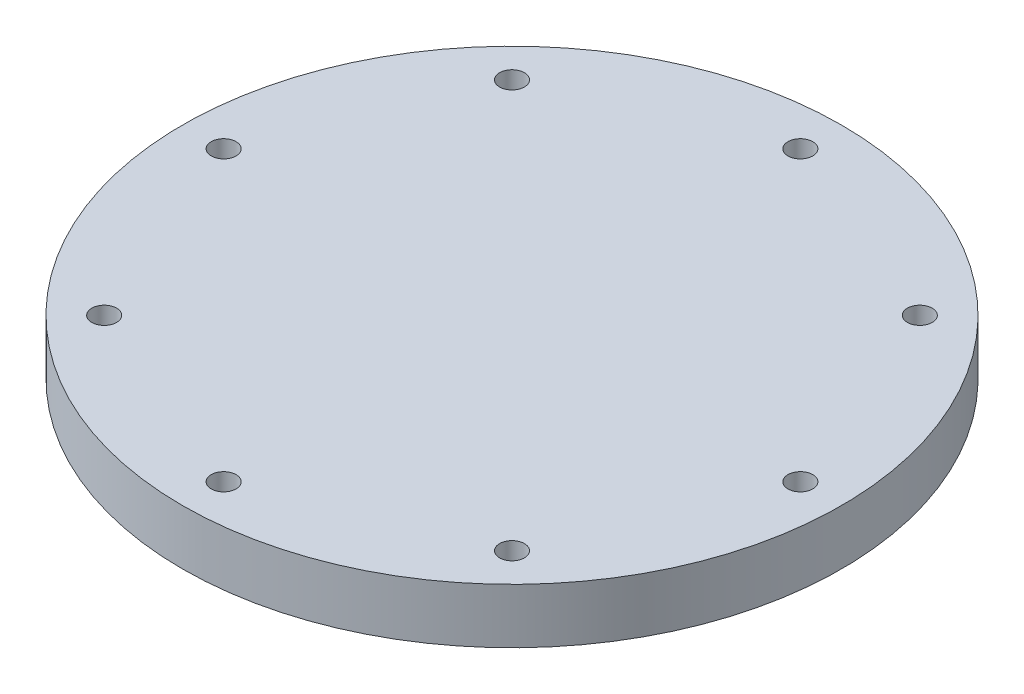
ISO-10303-21;
HEADER;
FILE_DESCRIPTION(('STEP AP214'),'2;1');
FILE_NAME('part.step','',(''),(''),'','','');
FILE_SCHEMA(('AUTOMOTIVE_DESIGN { 1 0 10303 214 1 1 1 1 }'));
ENDSEC;
DATA;
#1=APPLICATION_CONTEXT('core data for automotive mechanical design processes');
#2=APPLICATION_PROTOCOL_DEFINITION('international standard','automotive_design',2000,#1);
#3=PRODUCT_CONTEXT('',#1,'mechanical');
#4=PRODUCT('Part','Part','',(#3));
#5=PRODUCT_RELATED_PRODUCT_CATEGORY('part','',(#4));
#6=PRODUCT_DEFINITION_FORMATION('','',#4);
#7=PRODUCT_DEFINITION_CONTEXT('part definition',#1,'design');
#8=PRODUCT_DEFINITION('design','',#6,#7);
#9=PRODUCT_DEFINITION_SHAPE('','',#8);
#10=(LENGTH_UNIT() NAMED_UNIT(*) SI_UNIT(.MILLI.,.METRE.));
#11=(NAMED_UNIT(*) PLANE_ANGLE_UNIT() SI_UNIT($,.RADIAN.));
#12=(NAMED_UNIT(*) SI_UNIT($,.STERADIAN.) SOLID_ANGLE_UNIT());
#13=UNCERTAINTY_MEASURE_WITH_UNIT(LENGTH_MEASURE(1.E-05),#10,'distance_accuracy_value','');
#14=(GEOMETRIC_REPRESENTATION_CONTEXT(3) GLOBAL_UNCERTAINTY_ASSIGNED_CONTEXT((#13)) GLOBAL_UNIT_ASSIGNED_CONTEXT((#10,
#11,#12)) REPRESENTATION_CONTEXT('',''));
#15=CARTESIAN_POINT('',(0.,0.,0.));
#16=DIRECTION('',(0.,0.,1.));
#17=DIRECTION('',(1.,0.,0.));
#18=AXIS2_PLACEMENT_3D('',#15,#16,#17);
#19=CARTESIAN_POINT('',(0.,6.35,0.));
#20=DIRECTION('',(0.,-1.,0.));
#21=DIRECTION('',(0.,0.,-1.));
#22=AXIS2_PLACEMENT_3D('',#19,#20,#21);
#23=CYLINDRICAL_SURFACE('',#22,38.1);
#24=CARTESIAN_POINT('',(0.,6.35,0.));
#25=DIRECTION('',(0.,1.,0.));
#26=DIRECTION('',(0.,0.,1.));
#27=AXIS2_PLACEMENT_3D('',#24,#25,#26);
#28=CIRCLE('',#27,38.1);
#29=CARTESIAN_POINT('',(0.,6.35,38.1));
#30=VERTEX_POINT('',#29);
#31=EDGE_CURVE('E12',#30,#30,#28,.T.);
#32=ORIENTED_EDGE('',*,*,#31,.F.);
#33=EDGE_LOOP('',(#32));
#34=FACE_BOUND('',#33,.T.);
#35=CARTESIAN_POINT('',(0.,0.,0.));
#36=DIRECTION('',(0.,1.,0.));
#37=DIRECTION('',(0.,0.,1.));
#38=AXIS2_PLACEMENT_3D('',#35,#36,#37);
#39=CIRCLE('',#38,38.1);
#40=CARTESIAN_POINT('',(0.,0.,38.1));
#41=VERTEX_POINT('',#40);
#42=EDGE_CURVE('E48',#41,#41,#39,.T.);
#43=ORIENTED_EDGE('',*,*,#42,.T.);
#44=EDGE_LOOP('',(#43));
#45=FACE_BOUND('',#44,.T.);
#46=ADVANCED_FACE('F45',(#34,#45),#23,.T.);
#47=CARTESIAN_POINT('',(0.,6.35,0.));
#48=DIRECTION('',(0.,1.,0.));
#49=DIRECTION('',(0.,0.,1.));
#50=AXIS2_PLACEMENT_3D('',#47,#48,#49);
#51=PLANE('',#50);
#52=CARTESIAN_POINT('',(-23.5731723178062,6.35,23.5731723178068));
#53=DIRECTION('',(0.,-1.,0.));
#54=DIRECTION('',(0.,0.,-1.));
#55=AXIS2_PLACEMENT_3D('',#52,#53,#54);
#56=CIRCLE('',#55,1.4351);
#57=CARTESIAN_POINT('',(-23.5731723178062,6.35,22.1380723178068));
#58=VERTEX_POINT('',#57);
#59=EDGE_CURVE('E140',#58,#58,#56,.T.);
#60=ORIENTED_EDGE('',*,*,#59,.T.);
#61=EDGE_LOOP('',(#60));
#62=FACE_BOUND('',#61,.T.);
#63=CARTESIAN_POINT('',(-33.3375,6.35,3.49191777401049E-13));
#64=DIRECTION('',(0.,-1.,0.));
#65=DIRECTION('',(0.,0.,-1.));
#66=AXIS2_PLACEMENT_3D('',#63,#64,#65);
#67=CIRCLE('',#66,1.4351);
#68=CARTESIAN_POINT('',(-33.3375,6.35,-1.43509999999965));
#69=VERTEX_POINT('',#68);
#70=EDGE_CURVE('E128',#69,#69,#67,.T.);
#71=ORIENTED_EDGE('',*,*,#70,.T.);
#72=EDGE_LOOP('',(#71));
#73=FACE_BOUND('',#72,.T.);
#74=CARTESIAN_POINT('',(-23.5731723178067,6.35,-23.5731723178063));
#75=DIRECTION('',(0.,-1.,0.));
#76=DIRECTION('',(0.,0.,-1.));
#77=AXIS2_PLACEMENT_3D('',#74,#75,#76);
#78=CIRCLE('',#77,1.4351);
#79=CARTESIAN_POINT('',(-23.5731723178067,6.35,-25.0082723178063));
#80=VERTEX_POINT('',#79);
#81=EDGE_CURVE('E116',#80,#80,#78,.T.);
#82=ORIENTED_EDGE('',*,*,#81,.T.);
#83=EDGE_LOOP('',(#82));
#84=FACE_BOUND('',#83,.T.);
#85=CARTESIAN_POINT('',(0.,6.35,-33.3375));
#86=DIRECTION('',(0.,-1.,0.));
#87=DIRECTION('',(0.,0.,-1.));
#88=AXIS2_PLACEMENT_3D('',#85,#86,#87);
#89=CIRCLE('',#88,1.4351);
#90=CARTESIAN_POINT('',(0.,6.35,-34.7726));
#91=VERTEX_POINT('',#90);
#92=EDGE_CURVE('E104',#91,#91,#89,.T.);
#93=ORIENTED_EDGE('',*,*,#92,.T.);
#94=EDGE_LOOP('',(#93));
#95=FACE_BOUND('',#94,.T.);
#96=CARTESIAN_POINT('',(23.5731723178064,6.35,-23.5731723178067));
#97=DIRECTION('',(0.,-1.,0.));
#98=DIRECTION('',(0.,0.,-1.));
#99=AXIS2_PLACEMENT_3D('',#96,#97,#98);
#100=CIRCLE('',#99,1.4351);
#101=CARTESIAN_POINT('',(23.5731723178064,6.35,-25.0082723178067));
#102=VERTEX_POINT('',#101);
#103=EDGE_CURVE('E92',#102,#102,#100,.T.);
#104=ORIENTED_EDGE('',*,*,#103,.T.);
#105=EDGE_LOOP('',(#104));
#106=FACE_BOUND('',#105,.T.);
#107=CARTESIAN_POINT('',(33.3375,6.35,-1.16397259133683E-13));
#108=DIRECTION('',(0.,-1.,0.));
#109=DIRECTION('',(0.,0.,-1.));
#110=AXIS2_PLACEMENT_3D('',#107,#108,#109);
#111=CIRCLE('',#110,1.4351);
#112=CARTESIAN_POINT('',(33.3375,6.35,-1.43510000000012));
#113=VERTEX_POINT('',#112);
#114=EDGE_CURVE('E80',#113,#113,#111,.T.);
#115=ORIENTED_EDGE('',*,*,#114,.T.);
#116=EDGE_LOOP('',(#115));
#117=FACE_BOUND('',#116,.T.);
#118=CARTESIAN_POINT('',(23.5731723178066,6.35,23.5731723178065));
#119=DIRECTION('',(0.,-1.,0.));
#120=DIRECTION('',(0.,0.,-1.));
#121=AXIS2_PLACEMENT_3D('',#118,#119,#120);
#122=CIRCLE('',#121,1.4351);
#123=CARTESIAN_POINT('',(23.5731723178066,6.35,22.1380723178065));
#124=VERTEX_POINT('',#123);
#125=EDGE_CURVE('E68',#124,#124,#122,.T.);
#126=ORIENTED_EDGE('',*,*,#125,.T.);
#127=EDGE_LOOP('',(#126));
#128=FACE_BOUND('',#127,.T.);
#129=CARTESIAN_POINT('',(0.,6.35,33.3375));
#130=DIRECTION('',(0.,-1.,0.));
#131=DIRECTION('',(0.,0.,-1.));
#132=AXIS2_PLACEMENT_3D('',#129,#130,#131);
#133=CIRCLE('',#132,1.4351);
#134=CARTESIAN_POINT('',(0.,6.35,31.9024));
#135=VERTEX_POINT('',#134);
#136=EDGE_CURVE('E55',#135,#135,#133,.T.);
#137=ORIENTED_EDGE('',*,*,#136,.T.);
#138=EDGE_LOOP('',(#137));
#139=FACE_BOUND('',#138,.T.);
#140=ORIENTED_EDGE('',*,*,#31,.T.);
#141=EDGE_LOOP('',(#140));
#142=FACE_BOUND('',#141,.T.);
#143=ADVANCED_FACE('F159',(#62,#73,#84,#95,#106,#117,#128,#139,#142),#51,.T.);
#144=CARTESIAN_POINT('',(0.,0.,0.));
#145=DIRECTION('',(0.,1.,0.));
#146=DIRECTION('',(0.,0.,1.));
#147=AXIS2_PLACEMENT_3D('',#144,#145,#146);
#148=PLANE('',#147);
#149=CARTESIAN_POINT('',(-23.5731723178062,0.,23.5731723178068));
#150=DIRECTION('',(0.,-1.,0.));
#151=DIRECTION('',(0.,0.,-1.));
#152=AXIS2_PLACEMENT_3D('',#149,#150,#151);
#153=CIRCLE('',#152,2.413);
#154=CARTESIAN_POINT('',(-23.5731723178062,0.,21.1601723178068));
#155=VERTEX_POINT('',#154);
#156=EDGE_CURVE('E149',#155,#155,#153,.T.);
#157=ORIENTED_EDGE('',*,*,#156,.F.);
#158=EDGE_LOOP('',(#157));
#159=FACE_BOUND('',#158,.T.);
#160=CARTESIAN_POINT('',(-33.3375,0.,3.49191777401049E-13));
#161=DIRECTION('',(0.,-1.,0.));
#162=DIRECTION('',(0.,0.,-1.));
#163=AXIS2_PLACEMENT_3D('',#160,#161,#162);
#164=CIRCLE('',#163,2.413);
#165=CARTESIAN_POINT('',(-33.3375,0.,-2.41299999999965));
#166=VERTEX_POINT('',#165);
#167=EDGE_CURVE('E137',#166,#166,#164,.T.);
#168=ORIENTED_EDGE('',*,*,#167,.F.);
#169=EDGE_LOOP('',(#168));
#170=FACE_BOUND('',#169,.T.);
#171=CARTESIAN_POINT('',(-23.5731723178067,0.,-23.5731723178063));
#172=DIRECTION('',(0.,-1.,0.));
#173=DIRECTION('',(0.,0.,-1.));
#174=AXIS2_PLACEMENT_3D('',#171,#172,#173);
#175=CIRCLE('',#174,2.413);
#176=CARTESIAN_POINT('',(-23.5731723178067,0.,-25.9861723178063));
#177=VERTEX_POINT('',#176);
#178=EDGE_CURVE('E125',#177,#177,#175,.T.);
#179=ORIENTED_EDGE('',*,*,#178,.F.);
#180=EDGE_LOOP('',(#179));
#181=FACE_BOUND('',#180,.T.);
#182=CARTESIAN_POINT('',(0.,0.,-33.3375));
#183=DIRECTION('',(0.,-1.,0.));
#184=DIRECTION('',(0.,0.,-1.));
#185=AXIS2_PLACEMENT_3D('',#182,#183,#184);
#186=CIRCLE('',#185,2.413);
#187=CARTESIAN_POINT('',(0.,0.,-35.7505));
#188=VERTEX_POINT('',#187);
#189=EDGE_CURVE('E113',#188,#188,#186,.T.);
#190=ORIENTED_EDGE('',*,*,#189,.F.);
#191=EDGE_LOOP('',(#190));
#192=FACE_BOUND('',#191,.T.);
#193=CARTESIAN_POINT('',(23.5731723178064,0.,-23.5731723178067));
#194=DIRECTION('',(0.,-1.,0.));
#195=DIRECTION('',(0.,0.,-1.));
#196=AXIS2_PLACEMENT_3D('',#193,#194,#195);
#197=CIRCLE('',#196,2.413);
#198=CARTESIAN_POINT('',(23.5731723178064,0.,-25.9861723178067));
#199=VERTEX_POINT('',#198);
#200=EDGE_CURVE('E101',#199,#199,#197,.T.);
#201=ORIENTED_EDGE('',*,*,#200,.F.);
#202=EDGE_LOOP('',(#201));
#203=FACE_BOUND('',#202,.T.);
#204=CARTESIAN_POINT('',(33.3375,0.,-1.16397259133683E-13));
#205=DIRECTION('',(0.,-1.,0.));
#206=DIRECTION('',(0.,0.,-1.));
#207=AXIS2_PLACEMENT_3D('',#204,#205,#206);
#208=CIRCLE('',#207,2.413);
#209=CARTESIAN_POINT('',(33.3375,0.,-2.41300000000011));
#210=VERTEX_POINT('',#209);
#211=EDGE_CURVE('E89',#210,#210,#208,.T.);
#212=ORIENTED_EDGE('',*,*,#211,.F.);
#213=EDGE_LOOP('',(#212));
#214=FACE_BOUND('',#213,.T.);
#215=CARTESIAN_POINT('',(23.5731723178066,0.,23.5731723178065));
#216=DIRECTION('',(0.,-1.,0.));
#217=DIRECTION('',(0.,0.,-1.));
#218=AXIS2_PLACEMENT_3D('',#215,#216,#217);
#219=CIRCLE('',#218,2.413);
#220=CARTESIAN_POINT('',(23.5731723178066,0.,21.1601723178065));
#221=VERTEX_POINT('',#220);
#222=EDGE_CURVE('E77',#221,#221,#219,.T.);
#223=ORIENTED_EDGE('',*,*,#222,.F.);
#224=EDGE_LOOP('',(#223));
#225=FACE_BOUND('',#224,.T.);
#226=CARTESIAN_POINT('',(0.,0.,33.3375));
#227=DIRECTION('',(0.,-1.,0.));
#228=DIRECTION('',(0.,0.,-1.));
#229=AXIS2_PLACEMENT_3D('',#226,#227,#228);
#230=CIRCLE('',#229,2.413);
#231=CARTESIAN_POINT('',(0.,0.,30.9245));
#232=VERTEX_POINT('',#231);
#233=EDGE_CURVE('E65',#232,#232,#230,.T.);
#234=ORIENTED_EDGE('',*,*,#233,.F.);
#235=EDGE_LOOP('',(#234));
#236=FACE_BOUND('',#235,.T.);
#237=ORIENTED_EDGE('',*,*,#42,.F.);
#238=EDGE_LOOP('',(#237));
#239=FACE_BOUND('',#238,.T.);
#240=ADVANCED_FACE('F155',(#159,#170,#181,#192,#203,#214,#225,#236,#239),#148,.F.);
#241=CARTESIAN_POINT('',(0.,0.,33.3375));
#242=DIRECTION('',(0.,-1.,0.));
#243=DIRECTION('',(0.,0.,-1.));
#244=AXIS2_PLACEMENT_3D('',#241,#242,#243);
#245=CYLINDRICAL_SURFACE('',#244,1.4351);
#246=ORIENTED_EDGE('',*,*,#136,.F.);
#247=EDGE_LOOP('',(#246));
#248=FACE_BOUND('',#247,.T.);
#249=CARTESIAN_POINT('',(0.,1.905,33.3375));
#250=DIRECTION('',(0.,-1.,0.));
#251=DIRECTION('',(0.,0.,-1.));
#252=AXIS2_PLACEMENT_3D('',#249,#250,#251);
#253=CIRCLE('',#252,1.4351);
#254=CARTESIAN_POINT('',(0.,1.905,31.9024));
#255=VERTEX_POINT('',#254);
#256=EDGE_CURVE('E59',#255,#255,#253,.T.);
#257=ORIENTED_EDGE('',*,*,#256,.T.);
#258=EDGE_LOOP('',(#257));
#259=FACE_BOUND('',#258,.T.);
#260=ADVANCED_FACE('F158',(#248,#259),#245,.F.);
#261=CARTESIAN_POINT('',(1.4351,1.905,33.3375));
#262=DIRECTION('',(0.,1.,0.));
#263=DIRECTION('',(0.,0.,1.));
#264=AXIS2_PLACEMENT_3D('',#261,#262,#263);
#265=PLANE('',#264);
#266=ORIENTED_EDGE('',*,*,#256,.F.);
#267=EDGE_LOOP('',(#266));
#268=FACE_BOUND('',#267,.T.);
#269=CARTESIAN_POINT('',(0.,1.905,33.3375));
#270=DIRECTION('',(0.,-1.,0.));
#271=DIRECTION('',(0.,0.,-1.));
#272=AXIS2_PLACEMENT_3D('',#269,#270,#271);
#273=CIRCLE('',#272,2.413);
#274=CARTESIAN_POINT('',(0.,1.905,30.9245));
#275=VERTEX_POINT('',#274);
#276=EDGE_CURVE('E62',#275,#275,#273,.T.);
#277=ORIENTED_EDGE('',*,*,#276,.T.);
#278=EDGE_LOOP('',(#277));
#279=FACE_BOUND('',#278,.T.);
#280=ADVANCED_FACE('F189',(#268,#279),#265,.F.);
#281=CARTESIAN_POINT('',(0.,0.,33.3375));
#282=DIRECTION('',(0.,-1.,0.));
#283=DIRECTION('',(0.,0.,-1.));
#284=AXIS2_PLACEMENT_3D('',#281,#282,#283);
#285=CYLINDRICAL_SURFACE('',#284,2.413);
#286=ORIENTED_EDGE('',*,*,#276,.F.);
#287=EDGE_LOOP('',(#286));
#288=FACE_BOUND('',#287,.T.);
#289=ORIENTED_EDGE('',*,*,#233,.T.);
#290=EDGE_LOOP('',(#289));
#291=FACE_BOUND('',#290,.T.);
#292=ADVANCED_FACE('F193',(#288,#291),#285,.F.);
#293=CARTESIAN_POINT('',(23.5731723178066,0.,23.5731723178065));
#294=DIRECTION('',(0.,-1.,0.));
#295=DIRECTION('',(0.,0.,-1.));
#296=AXIS2_PLACEMENT_3D('',#293,#294,#295);
#297=CYLINDRICAL_SURFACE('',#296,1.4351);
#298=ORIENTED_EDGE('',*,*,#125,.F.);
#299=EDGE_LOOP('',(#298));
#300=FACE_BOUND('',#299,.T.);
#301=CARTESIAN_POINT('',(23.5731723178066,1.905,23.5731723178065));
#302=DIRECTION('',(0.,-1.,0.));
#303=DIRECTION('',(0.,0.,-1.));
#304=AXIS2_PLACEMENT_3D('',#301,#302,#303);
#305=CIRCLE('',#304,1.4351);
#306=CARTESIAN_POINT('',(23.5731723178066,1.905,22.1380723178065));
#307=VERTEX_POINT('',#306);
#308=EDGE_CURVE('E71',#307,#307,#305,.T.);
#309=ORIENTED_EDGE('',*,*,#308,.T.);
#310=EDGE_LOOP('',(#309));
#311=FACE_BOUND('',#310,.T.);
#312=ADVANCED_FACE('F197',(#300,#311),#297,.F.);
#313=CARTESIAN_POINT('',(25.0082723178066,1.905,23.5731723178065));
#314=DIRECTION('',(0.,1.,0.));
#315=DIRECTION('',(0.,0.,1.));
#316=AXIS2_PLACEMENT_3D('',#313,#314,#315);
#317=PLANE('',#316);
#318=ORIENTED_EDGE('',*,*,#308,.F.);
#319=EDGE_LOOP('',(#318));
#320=FACE_BOUND('',#319,.T.);
#321=CARTESIAN_POINT('',(23.5731723178066,1.905,23.5731723178065));
#322=DIRECTION('',(0.,-1.,0.));
#323=DIRECTION('',(0.,0.,-1.));
#324=AXIS2_PLACEMENT_3D('',#321,#322,#323);
#325=CIRCLE('',#324,2.413);
#326=CARTESIAN_POINT('',(23.5731723178066,1.905,21.1601723178065));
#327=VERTEX_POINT('',#326);
#328=EDGE_CURVE('E74',#327,#327,#325,.T.);
#329=ORIENTED_EDGE('',*,*,#328,.T.);
#330=EDGE_LOOP('',(#329));
#331=FACE_BOUND('',#330,.T.);
#332=ADVANCED_FACE('F201',(#320,#331),#317,.F.);
#333=CARTESIAN_POINT('',(23.5731723178066,0.,23.5731723178065));
#334=DIRECTION('',(0.,-1.,0.));
#335=DIRECTION('',(0.,0.,-1.));
#336=AXIS2_PLACEMENT_3D('',#333,#334,#335);
#337=CYLINDRICAL_SURFACE('',#336,2.413);
#338=ORIENTED_EDGE('',*,*,#328,.F.);
#339=EDGE_LOOP('',(#338));
#340=FACE_BOUND('',#339,.T.);
#341=ORIENTED_EDGE('',*,*,#222,.T.);
#342=EDGE_LOOP('',(#341));
#343=FACE_BOUND('',#342,.T.);
#344=ADVANCED_FACE('F205',(#340,#343),#337,.F.);
#345=CARTESIAN_POINT('',(33.3375,0.,-1.16397259133683E-13));
#346=DIRECTION('',(0.,-1.,0.));
#347=DIRECTION('',(0.,0.,-1.));
#348=AXIS2_PLACEMENT_3D('',#345,#346,#347);
#349=CYLINDRICAL_SURFACE('',#348,1.4351);
#350=ORIENTED_EDGE('',*,*,#114,.F.);
#351=EDGE_LOOP('',(#350));
#352=FACE_BOUND('',#351,.T.);
#353=CARTESIAN_POINT('',(33.3375,1.905,-1.16397259133683E-13));
#354=DIRECTION('',(0.,-1.,0.));
#355=DIRECTION('',(0.,0.,-1.));
#356=AXIS2_PLACEMENT_3D('',#353,#354,#355);
#357=CIRCLE('',#356,1.4351);
#358=CARTESIAN_POINT('',(33.3375,1.905,-1.43510000000012));
#359=VERTEX_POINT('',#358);
#360=EDGE_CURVE('E83',#359,#359,#357,.T.);
#361=ORIENTED_EDGE('',*,*,#360,.T.);
#362=EDGE_LOOP('',(#361));
#363=FACE_BOUND('',#362,.T.);
#364=ADVANCED_FACE('F209',(#352,#363),#349,.F.);
#365=CARTESIAN_POINT('',(34.7726,1.905,-1.16397259133683E-13));
#366=DIRECTION('',(0.,1.,0.));
#367=DIRECTION('',(0.,0.,1.));
#368=AXIS2_PLACEMENT_3D('',#365,#366,#367);
#369=PLANE('',#368);
#370=ORIENTED_EDGE('',*,*,#360,.F.);
#371=EDGE_LOOP('',(#370));
#372=FACE_BOUND('',#371,.T.);
#373=CARTESIAN_POINT('',(33.3375,1.905,-1.16397259133683E-13));
#374=DIRECTION('',(0.,-1.,0.));
#375=DIRECTION('',(0.,0.,-1.));
#376=AXIS2_PLACEMENT_3D('',#373,#374,#375);
#377=CIRCLE('',#376,2.413);
#378=CARTESIAN_POINT('',(33.3375,1.905,-2.41300000000011));
#379=VERTEX_POINT('',#378);
#380=EDGE_CURVE('E86',#379,#379,#377,.T.);
#381=ORIENTED_EDGE('',*,*,#380,.T.);
#382=EDGE_LOOP('',(#381));
#383=FACE_BOUND('',#382,.T.);
#384=ADVANCED_FACE('F213',(#372,#383),#369,.F.);
#385=CARTESIAN_POINT('',(33.3375,0.,-1.16397259133683E-13));
#386=DIRECTION('',(0.,-1.,0.));
#387=DIRECTION('',(0.,0.,-1.));
#388=AXIS2_PLACEMENT_3D('',#385,#386,#387);
#389=CYLINDRICAL_SURFACE('',#388,2.413);
#390=ORIENTED_EDGE('',*,*,#380,.F.);
#391=EDGE_LOOP('',(#390));
#392=FACE_BOUND('',#391,.T.);
#393=ORIENTED_EDGE('',*,*,#211,.T.);
#394=EDGE_LOOP('',(#393));
#395=FACE_BOUND('',#394,.T.);
#396=ADVANCED_FACE('F217',(#392,#395),#389,.F.);
#397=CARTESIAN_POINT('',(23.5731723178064,0.,-23.5731723178067));
#398=DIRECTION('',(0.,-1.,0.));
#399=DIRECTION('',(0.,0.,-1.));
#400=AXIS2_PLACEMENT_3D('',#397,#398,#399);
#401=CYLINDRICAL_SURFACE('',#400,1.4351);
#402=ORIENTED_EDGE('',*,*,#103,.F.);
#403=EDGE_LOOP('',(#402));
#404=FACE_BOUND('',#403,.T.);
#405=CARTESIAN_POINT('',(23.5731723178064,1.905,-23.5731723178067));
#406=DIRECTION('',(0.,-1.,0.));
#407=DIRECTION('',(0.,0.,-1.));
#408=AXIS2_PLACEMENT_3D('',#405,#406,#407);
#409=CIRCLE('',#408,1.4351);
#410=CARTESIAN_POINT('',(23.5731723178064,1.905,-25.0082723178067));
#411=VERTEX_POINT('',#410);
#412=EDGE_CURVE('E95',#411,#411,#409,.T.);
#413=ORIENTED_EDGE('',*,*,#412,.T.);
#414=EDGE_LOOP('',(#413));
#415=FACE_BOUND('',#414,.T.);
#416=ADVANCED_FACE('F221',(#404,#415),#401,.F.);
#417=CARTESIAN_POINT('',(25.0082723178064,1.905,-23.5731723178067));
#418=DIRECTION('',(0.,1.,0.));
#419=DIRECTION('',(0.,0.,1.));
#420=AXIS2_PLACEMENT_3D('',#417,#418,#419);
#421=PLANE('',#420);
#422=ORIENTED_EDGE('',*,*,#412,.F.);
#423=EDGE_LOOP('',(#422));
#424=FACE_BOUND('',#423,.T.);
#425=CARTESIAN_POINT('',(23.5731723178064,1.905,-23.5731723178067));
#426=DIRECTION('',(0.,-1.,0.));
#427=DIRECTION('',(0.,0.,-1.));
#428=AXIS2_PLACEMENT_3D('',#425,#426,#427);
#429=CIRCLE('',#428,2.413);
#430=CARTESIAN_POINT('',(23.5731723178064,1.905,-25.9861723178067));
#431=VERTEX_POINT('',#430);
#432=EDGE_CURVE('E98',#431,#431,#429,.T.);
#433=ORIENTED_EDGE('',*,*,#432,.T.);
#434=EDGE_LOOP('',(#433));
#435=FACE_BOUND('',#434,.T.);
#436=ADVANCED_FACE('F225',(#424,#435),#421,.F.);
#437=CARTESIAN_POINT('',(23.5731723178064,0.,-23.5731723178067));
#438=DIRECTION('',(0.,-1.,0.));
#439=DIRECTION('',(0.,0.,-1.));
#440=AXIS2_PLACEMENT_3D('',#437,#438,#439);
#441=CYLINDRICAL_SURFACE('',#440,2.413);
#442=ORIENTED_EDGE('',*,*,#432,.F.);
#443=EDGE_LOOP('',(#442));
#444=FACE_BOUND('',#443,.T.);
#445=ORIENTED_EDGE('',*,*,#200,.T.);
#446=EDGE_LOOP('',(#445));
#447=FACE_BOUND('',#446,.T.);
#448=ADVANCED_FACE('F229',(#444,#447),#441,.F.);
#449=CARTESIAN_POINT('',(0.,0.,-33.3375));
#450=DIRECTION('',(0.,-1.,0.));
#451=DIRECTION('',(0.,0.,-1.));
#452=AXIS2_PLACEMENT_3D('',#449,#450,#451);
#453=CYLINDRICAL_SURFACE('',#452,1.4351);
#454=ORIENTED_EDGE('',*,*,#92,.F.);
#455=EDGE_LOOP('',(#454));
#456=FACE_BOUND('',#455,.T.);
#457=CARTESIAN_POINT('',(0.,1.905,-33.3375));
#458=DIRECTION('',(0.,-1.,0.));
#459=DIRECTION('',(0.,0.,-1.));
#460=AXIS2_PLACEMENT_3D('',#457,#458,#459);
#461=CIRCLE('',#460,1.4351);
#462=CARTESIAN_POINT('',(0.,1.905,-34.7726));
#463=VERTEX_POINT('',#462);
#464=EDGE_CURVE('E107',#463,#463,#461,.T.);
#465=ORIENTED_EDGE('',*,*,#464,.T.);
#466=EDGE_LOOP('',(#465));
#467=FACE_BOUND('',#466,.T.);
#468=ADVANCED_FACE('F233',(#456,#467),#453,.F.);
#469=CARTESIAN_POINT('',(1.4351,1.905,-33.3375));
#470=DIRECTION('',(0.,1.,0.));
#471=DIRECTION('',(0.,0.,1.));
#472=AXIS2_PLACEMENT_3D('',#469,#470,#471);
#473=PLANE('',#472);
#474=ORIENTED_EDGE('',*,*,#464,.F.);
#475=EDGE_LOOP('',(#474));
#476=FACE_BOUND('',#475,.T.);
#477=CARTESIAN_POINT('',(0.,1.905,-33.3375));
#478=DIRECTION('',(0.,-1.,0.));
#479=DIRECTION('',(0.,0.,-1.));
#480=AXIS2_PLACEMENT_3D('',#477,#478,#479);
#481=CIRCLE('',#480,2.413);
#482=CARTESIAN_POINT('',(0.,1.905,-35.7505));
#483=VERTEX_POINT('',#482);
#484=EDGE_CURVE('E110',#483,#483,#481,.T.);
#485=ORIENTED_EDGE('',*,*,#484,.T.);
#486=EDGE_LOOP('',(#485));
#487=FACE_BOUND('',#486,.T.);
#488=ADVANCED_FACE('F237',(#476,#487),#473,.F.);
#489=CARTESIAN_POINT('',(0.,0.,-33.3375));
#490=DIRECTION('',(0.,-1.,0.));
#491=DIRECTION('',(0.,0.,-1.));
#492=AXIS2_PLACEMENT_3D('',#489,#490,#491);
#493=CYLINDRICAL_SURFACE('',#492,2.413);
#494=ORIENTED_EDGE('',*,*,#484,.F.);
#495=EDGE_LOOP('',(#494));
#496=FACE_BOUND('',#495,.T.);
#497=ORIENTED_EDGE('',*,*,#189,.T.);
#498=EDGE_LOOP('',(#497));
#499=FACE_BOUND('',#498,.T.);
#500=ADVANCED_FACE('F241',(#496,#499),#493,.F.);
#501=CARTESIAN_POINT('',(-23.5731723178067,0.,-23.5731723178063));
#502=DIRECTION('',(0.,-1.,0.));
#503=DIRECTION('',(0.,0.,-1.));
#504=AXIS2_PLACEMENT_3D('',#501,#502,#503);
#505=CYLINDRICAL_SURFACE('',#504,1.4351);
#506=ORIENTED_EDGE('',*,*,#81,.F.);
#507=EDGE_LOOP('',(#506));
#508=FACE_BOUND('',#507,.T.);
#509=CARTESIAN_POINT('',(-23.5731723178067,1.905,-23.5731723178063));
#510=DIRECTION('',(0.,-1.,0.));
#511=DIRECTION('',(0.,0.,-1.));
#512=AXIS2_PLACEMENT_3D('',#509,#510,#511);
#513=CIRCLE('',#512,1.4351);
#514=CARTESIAN_POINT('',(-23.5731723178067,1.905,-25.0082723178063));
#515=VERTEX_POINT('',#514);
#516=EDGE_CURVE('E119',#515,#515,#513,.T.);
#517=ORIENTED_EDGE('',*,*,#516,.T.);
#518=EDGE_LOOP('',(#517));
#519=FACE_BOUND('',#518,.T.);
#520=ADVANCED_FACE('F245',(#508,#519),#505,.F.);
#521=CARTESIAN_POINT('',(-22.1380723178067,1.905,-23.5731723178063));
#522=DIRECTION('',(0.,1.,0.));
#523=DIRECTION('',(0.,0.,1.));
#524=AXIS2_PLACEMENT_3D('',#521,#522,#523);
#525=PLANE('',#524);
#526=ORIENTED_EDGE('',*,*,#516,.F.);
#527=EDGE_LOOP('',(#526));
#528=FACE_BOUND('',#527,.T.);
#529=CARTESIAN_POINT('',(-23.5731723178067,1.905,-23.5731723178063));
#530=DIRECTION('',(0.,-1.,0.));
#531=DIRECTION('',(0.,0.,-1.));
#532=AXIS2_PLACEMENT_3D('',#529,#530,#531);
#533=CIRCLE('',#532,2.413);
#534=CARTESIAN_POINT('',(-23.5731723178067,1.905,-25.9861723178063));
#535=VERTEX_POINT('',#534);
#536=EDGE_CURVE('E122',#535,#535,#533,.T.);
#537=ORIENTED_EDGE('',*,*,#536,.T.);
#538=EDGE_LOOP('',(#537));
#539=FACE_BOUND('',#538,.T.);
#540=ADVANCED_FACE('F249',(#528,#539),#525,.F.);
#541=CARTESIAN_POINT('',(-23.5731723178067,0.,-23.5731723178063));
#542=DIRECTION('',(0.,-1.,0.));
#543=DIRECTION('',(0.,0.,-1.));
#544=AXIS2_PLACEMENT_3D('',#541,#542,#543);
#545=CYLINDRICAL_SURFACE('',#544,2.413);
#546=ORIENTED_EDGE('',*,*,#536,.F.);
#547=EDGE_LOOP('',(#546));
#548=FACE_BOUND('',#547,.T.);
#549=ORIENTED_EDGE('',*,*,#178,.T.);
#550=EDGE_LOOP('',(#549));
#551=FACE_BOUND('',#550,.T.);
#552=ADVANCED_FACE('F253',(#548,#551),#545,.F.);
#553=CARTESIAN_POINT('',(-33.3375,0.,3.49191777401049E-13));
#554=DIRECTION('',(0.,-1.,0.));
#555=DIRECTION('',(0.,0.,-1.));
#556=AXIS2_PLACEMENT_3D('',#553,#554,#555);
#557=CYLINDRICAL_SURFACE('',#556,1.4351);
#558=ORIENTED_EDGE('',*,*,#70,.F.);
#559=EDGE_LOOP('',(#558));
#560=FACE_BOUND('',#559,.T.);
#561=CARTESIAN_POINT('',(-33.3375,1.905,3.49191777401049E-13));
#562=DIRECTION('',(0.,-1.,0.));
#563=DIRECTION('',(0.,0.,-1.));
#564=AXIS2_PLACEMENT_3D('',#561,#562,#563);
#565=CIRCLE('',#564,1.4351);
#566=CARTESIAN_POINT('',(-33.3375,1.905,-1.43509999999965));
#567=VERTEX_POINT('',#566);
#568=EDGE_CURVE('E131',#567,#567,#565,.T.);
#569=ORIENTED_EDGE('',*,*,#568,.T.);
#570=EDGE_LOOP('',(#569));
#571=FACE_BOUND('',#570,.T.);
#572=ADVANCED_FACE('F257',(#560,#571),#557,.F.);
#573=CARTESIAN_POINT('',(-31.9024,1.905,3.49191777401049E-13));
#574=DIRECTION('',(0.,1.,0.));
#575=DIRECTION('',(0.,0.,1.));
#576=AXIS2_PLACEMENT_3D('',#573,#574,#575);
#577=PLANE('',#576);
#578=ORIENTED_EDGE('',*,*,#568,.F.);
#579=EDGE_LOOP('',(#578));
#580=FACE_BOUND('',#579,.T.);
#581=CARTESIAN_POINT('',(-33.3375,1.905,3.49191777401049E-13));
#582=DIRECTION('',(0.,-1.,0.));
#583=DIRECTION('',(0.,0.,-1.));
#584=AXIS2_PLACEMENT_3D('',#581,#582,#583);
#585=CIRCLE('',#584,2.413);
#586=CARTESIAN_POINT('',(-33.3375,1.905,-2.41299999999965));
#587=VERTEX_POINT('',#586);
#588=EDGE_CURVE('E134',#587,#587,#585,.T.);
#589=ORIENTED_EDGE('',*,*,#588,.T.);
#590=EDGE_LOOP('',(#589));
#591=FACE_BOUND('',#590,.T.);
#592=ADVANCED_FACE('F261',(#580,#591),#577,.F.);
#593=CARTESIAN_POINT('',(-33.3375,0.,3.49191777401049E-13));
#594=DIRECTION('',(0.,-1.,0.));
#595=DIRECTION('',(0.,0.,-1.));
#596=AXIS2_PLACEMENT_3D('',#593,#594,#595);
#597=CYLINDRICAL_SURFACE('',#596,2.413);
#598=ORIENTED_EDGE('',*,*,#588,.F.);
#599=EDGE_LOOP('',(#598));
#600=FACE_BOUND('',#599,.T.);
#601=ORIENTED_EDGE('',*,*,#167,.T.);
#602=EDGE_LOOP('',(#601));
#603=FACE_BOUND('',#602,.T.);
#604=ADVANCED_FACE('F265',(#600,#603),#597,.F.);
#605=CARTESIAN_POINT('',(-23.5731723178062,0.,23.5731723178068));
#606=DIRECTION('',(0.,-1.,0.));
#607=DIRECTION('',(0.,0.,-1.));
#608=AXIS2_PLACEMENT_3D('',#605,#606,#607);
#609=CYLINDRICAL_SURFACE('',#608,1.4351);
#610=ORIENTED_EDGE('',*,*,#59,.F.);
#611=EDGE_LOOP('',(#610));
#612=FACE_BOUND('',#611,.T.);
#613=CARTESIAN_POINT('',(-23.5731723178062,1.905,23.5731723178068));
#614=DIRECTION('',(0.,-1.,0.));
#615=DIRECTION('',(0.,0.,-1.));
#616=AXIS2_PLACEMENT_3D('',#613,#614,#615);
#617=CIRCLE('',#616,1.4351);
#618=CARTESIAN_POINT('',(-23.5731723178062,1.905,22.1380723178068));
#619=VERTEX_POINT('',#618);
#620=EDGE_CURVE('E143',#619,#619,#617,.T.);
#621=ORIENTED_EDGE('',*,*,#620,.T.);
#622=EDGE_LOOP('',(#621));
#623=FACE_BOUND('',#622,.T.);
#624=ADVANCED_FACE('F269',(#612,#623),#609,.F.);
#625=CARTESIAN_POINT('',(-22.1380723178062,1.905,23.5731723178068));
#626=DIRECTION('',(0.,1.,0.));
#627=DIRECTION('',(0.,0.,1.));
#628=AXIS2_PLACEMENT_3D('',#625,#626,#627);
#629=PLANE('',#628);
#630=ORIENTED_EDGE('',*,*,#620,.F.);
#631=EDGE_LOOP('',(#630));
#632=FACE_BOUND('',#631,.T.);
#633=CARTESIAN_POINT('',(-23.5731723178062,1.905,23.5731723178068));
#634=DIRECTION('',(0.,-1.,0.));
#635=DIRECTION('',(0.,0.,-1.));
#636=AXIS2_PLACEMENT_3D('',#633,#634,#635);
#637=CIRCLE('',#636,2.413);
#638=CARTESIAN_POINT('',(-23.5731723178062,1.905,21.1601723178068));
#639=VERTEX_POINT('',#638);
#640=EDGE_CURVE('E146',#639,#639,#637,.T.);
#641=ORIENTED_EDGE('',*,*,#640,.T.);
#642=EDGE_LOOP('',(#641));
#643=FACE_BOUND('',#642,.T.);
#644=ADVANCED_FACE('F273',(#632,#643),#629,.F.);
#645=CARTESIAN_POINT('',(-23.5731723178062,0.,23.5731723178068));
#646=DIRECTION('',(0.,-1.,0.));
#647=DIRECTION('',(0.,0.,-1.));
#648=AXIS2_PLACEMENT_3D('',#645,#646,#647);
#649=CYLINDRICAL_SURFACE('',#648,2.413);
#650=ORIENTED_EDGE('',*,*,#640,.F.);
#651=EDGE_LOOP('',(#650));
#652=FACE_BOUND('',#651,.T.);
#653=ORIENTED_EDGE('',*,*,#156,.T.);
#654=EDGE_LOOP('',(#653));
#655=FACE_BOUND('',#654,.T.);
#656=ADVANCED_FACE('F153',(#652,#655),#649,.F.);
#657=CLOSED_SHELL('',(#46,#143,#240,#260,#280,#292,#312,#332,#344,#364,#384,#396,#416,#436,#448,
#468,#488,#500,#520,#540,#552,#572,#592,#604,#624,#644,#656));
#658=MANIFOLD_SOLID_BREP('B2',#657);
#659=ADVANCED_BREP_SHAPE_REPRESENTATION('',(#18,#658),#14);
#660=SHAPE_DEFINITION_REPRESENTATION(#9,#659);
ENDSEC;
END-ISO-10303-21;
